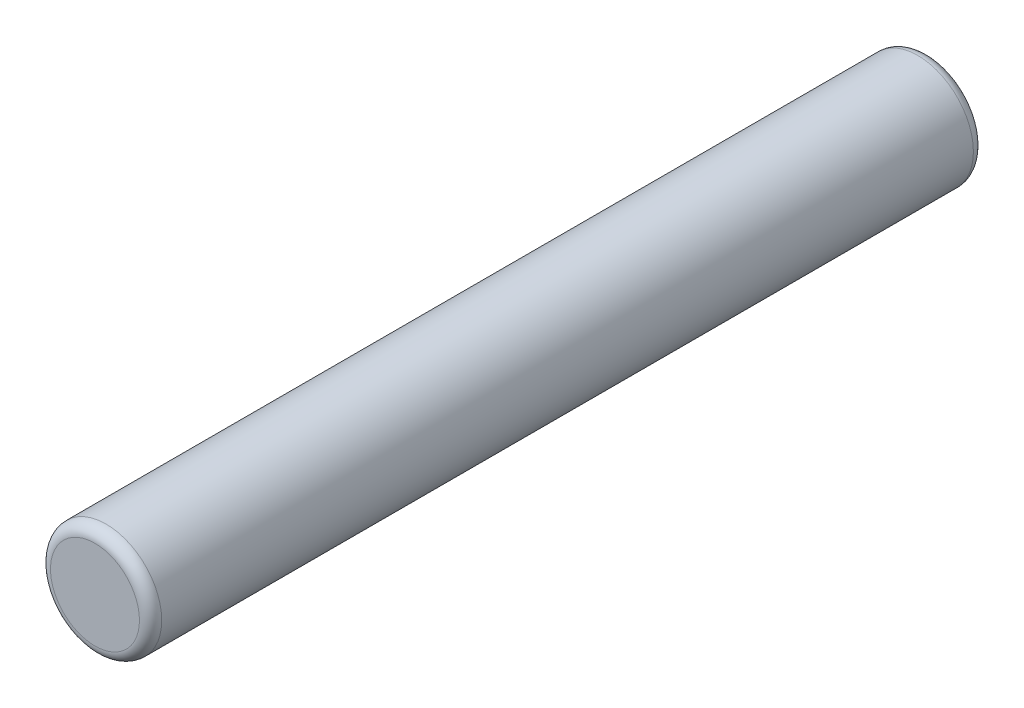
ISO-10303-21;
HEADER;
FILE_DESCRIPTION(('STEP AP214'),'2;1');
FILE_NAME('part.step','',(''),(''),'','','');
FILE_SCHEMA(('AUTOMOTIVE_DESIGN { 1 0 10303 214 1 1 1 1 }'));
ENDSEC;
DATA;
#1=APPLICATION_CONTEXT('core data for automotive mechanical design processes');
#2=APPLICATION_PROTOCOL_DEFINITION('international standard','automotive_design',2000,#1);
#3=PRODUCT_CONTEXT('',#1,'mechanical');
#4=PRODUCT('Part','Part','',(#3));
#5=PRODUCT_RELATED_PRODUCT_CATEGORY('part','',(#4));
#6=PRODUCT_DEFINITION_FORMATION('','',#4);
#7=PRODUCT_DEFINITION_CONTEXT('part definition',#1,'design');
#8=PRODUCT_DEFINITION('design','',#6,#7);
#9=PRODUCT_DEFINITION_SHAPE('','',#8);
#10=(LENGTH_UNIT() NAMED_UNIT(*) SI_UNIT(.MILLI.,.METRE.));
#11=(NAMED_UNIT(*) PLANE_ANGLE_UNIT() SI_UNIT($,.RADIAN.));
#12=(NAMED_UNIT(*) SI_UNIT($,.STERADIAN.) SOLID_ANGLE_UNIT());
#13=UNCERTAINTY_MEASURE_WITH_UNIT(LENGTH_MEASURE(1.E-05),#10,'distance_accuracy_value','');
#14=(GEOMETRIC_REPRESENTATION_CONTEXT(3) GLOBAL_UNCERTAINTY_ASSIGNED_CONTEXT((#13)) GLOBAL_UNIT_ASSIGNED_CONTEXT((#10,
#11,#12)) REPRESENTATION_CONTEXT('',''));
#15=CARTESIAN_POINT('',(0.,0.,0.));
#16=DIRECTION('',(0.,0.,1.));
#17=DIRECTION('',(1.,0.,0.));
#18=AXIS2_PLACEMENT_3D('',#15,#16,#17);
#19=CARTESIAN_POINT('',(-17.85814360587,10.9477594339623,15.));
#20=DIRECTION('',(0.,0.,-1.));
#21=DIRECTION('',(-1.,0.,0.));
#22=AXIS2_PLACEMENT_3D('',#19,#20,#21);
#23=CYLINDRICAL_SURFACE('',#22,1.);
#24=CARTESIAN_POINT('',(-17.85814360587,10.9477594339623,0.200000000000001));
#25=DIRECTION('',(0.,0.,1.));
#26=DIRECTION('',(1.,0.,0.));
#27=AXIS2_PLACEMENT_3D('',#24,#25,#26);
#28=CIRCLE('',#27,1.);
#29=CARTESIAN_POINT('',(-16.85814360587,10.9477594339623,0.200000000000001));
#30=VERTEX_POINT('',#29);
#31=EDGE_CURVE('E42',#30,#30,#28,.T.);
#32=ORIENTED_EDGE('',*,*,#31,.T.);
#33=EDGE_LOOP('',(#32));
#34=FACE_BOUND('',#33,.T.);
#35=CARTESIAN_POINT('',(-17.85814360587,10.9477594339623,14.8));
#36=DIRECTION('',(0.,0.,1.));
#37=DIRECTION('',(1.,0.,0.));
#38=AXIS2_PLACEMENT_3D('',#35,#36,#37);
#39=CIRCLE('',#38,1.);
#40=CARTESIAN_POINT('',(-16.85814360587,10.9477594339623,14.8));
#41=VERTEX_POINT('',#40);
#42=EDGE_CURVE('E46',#41,#41,#39,.F.);
#43=ORIENTED_EDGE('',*,*,#42,.T.);
#44=EDGE_LOOP('',(#43));
#45=FACE_BOUND('',#44,.T.);
#46=ADVANCED_FACE('F31',(#34,#45),#23,.T.);
#47=CARTESIAN_POINT('',(-17.85814360587,10.9477594339623,15.));
#48=DIRECTION('',(0.,0.,1.));
#49=DIRECTION('',(1.,0.,0.));
#50=AXIS2_PLACEMENT_3D('',#47,#48,#49);
#51=PLANE('',#50);
#52=CARTESIAN_POINT('',(-17.85814360587,10.9477594339623,15.));
#53=DIRECTION('',(0.,0.,1.));
#54=DIRECTION('',(1.,0.,0.));
#55=AXIS2_PLACEMENT_3D('',#52,#53,#54);
#56=CIRCLE('',#55,0.800000000000002);
#57=CARTESIAN_POINT('',(-17.05814360587,10.9477594339623,15.));
#58=VERTEX_POINT('',#57);
#59=EDGE_CURVE('E10',#58,#58,#56,.T.);
#60=ORIENTED_EDGE('',*,*,#59,.T.);
#61=EDGE_LOOP('',(#60));
#62=FACE_BOUND('',#61,.T.);
#63=ADVANCED_FACE('F62',(#62),#51,.T.);
#64=CARTESIAN_POINT('',(-17.85814360587,10.9477594339623,0.));
#65=DIRECTION('',(0.,0.,1.));
#66=DIRECTION('',(1.,0.,0.));
#67=AXIS2_PLACEMENT_3D('',#64,#65,#66);
#68=PLANE('',#67);
#69=CARTESIAN_POINT('',(-17.85814360587,10.9477594339623,0.));
#70=DIRECTION('',(0.,0.,1.));
#71=DIRECTION('',(1.,0.,0.));
#72=AXIS2_PLACEMENT_3D('',#69,#70,#71);
#73=CIRCLE('',#72,0.800000000000002);
#74=CARTESIAN_POINT('',(-17.05814360587,10.9477594339623,0.));
#75=VERTEX_POINT('',#74);
#76=EDGE_CURVE('E38',#75,#75,#73,.F.);
#77=ORIENTED_EDGE('',*,*,#76,.T.);
#78=EDGE_LOOP('',(#77));
#79=FACE_BOUND('',#78,.T.);
#80=ADVANCED_FACE('F59',(#79),#68,.F.);
#81=CARTESIAN_POINT('',(-17.85814360587,10.9477594339623,0.200000000000001));
#82=DIRECTION('',(0.,0.,1.));
#83=DIRECTION('',(1.,0.,0.));
#84=AXIS2_PLACEMENT_3D('',#81,#82,#83);
#85=TOROIDAL_SURFACE('',#84,0.800000000000002,0.2);
#86=ORIENTED_EDGE('',*,*,#76,.F.);
#87=EDGE_LOOP('',(#86));
#88=FACE_BOUND('',#87,.T.);
#89=ORIENTED_EDGE('',*,*,#31,.F.);
#90=EDGE_LOOP('',(#89));
#91=FACE_BOUND('',#90,.T.);
#92=ADVANCED_FACE('F55',(#88,#91),#85,.T.);
#93=CARTESIAN_POINT('',(-17.85814360587,10.9477594339623,14.8));
#94=DIRECTION('',(0.,0.,1.));
#95=DIRECTION('',(1.,0.,0.));
#96=AXIS2_PLACEMENT_3D('',#93,#94,#95);
#97=TOROIDAL_SURFACE('',#96,0.800000000000002,0.2);
#98=ORIENTED_EDGE('',*,*,#42,.F.);
#99=EDGE_LOOP('',(#98));
#100=FACE_BOUND('',#99,.T.);
#101=ORIENTED_EDGE('',*,*,#59,.F.);
#102=EDGE_LOOP('',(#101));
#103=FACE_BOUND('',#102,.T.);
#104=ADVANCED_FACE('F33',(#100,#103),#97,.T.);
#105=CLOSED_SHELL('',(#46,#63,#80,#92,#104));
#106=MANIFOLD_SOLID_BREP('B2',#105);
#107=ADVANCED_BREP_SHAPE_REPRESENTATION('',(#18,#106),#14);
#108=SHAPE_DEFINITION_REPRESENTATION(#9,#107);
ENDSEC;
END-ISO-10303-21;
